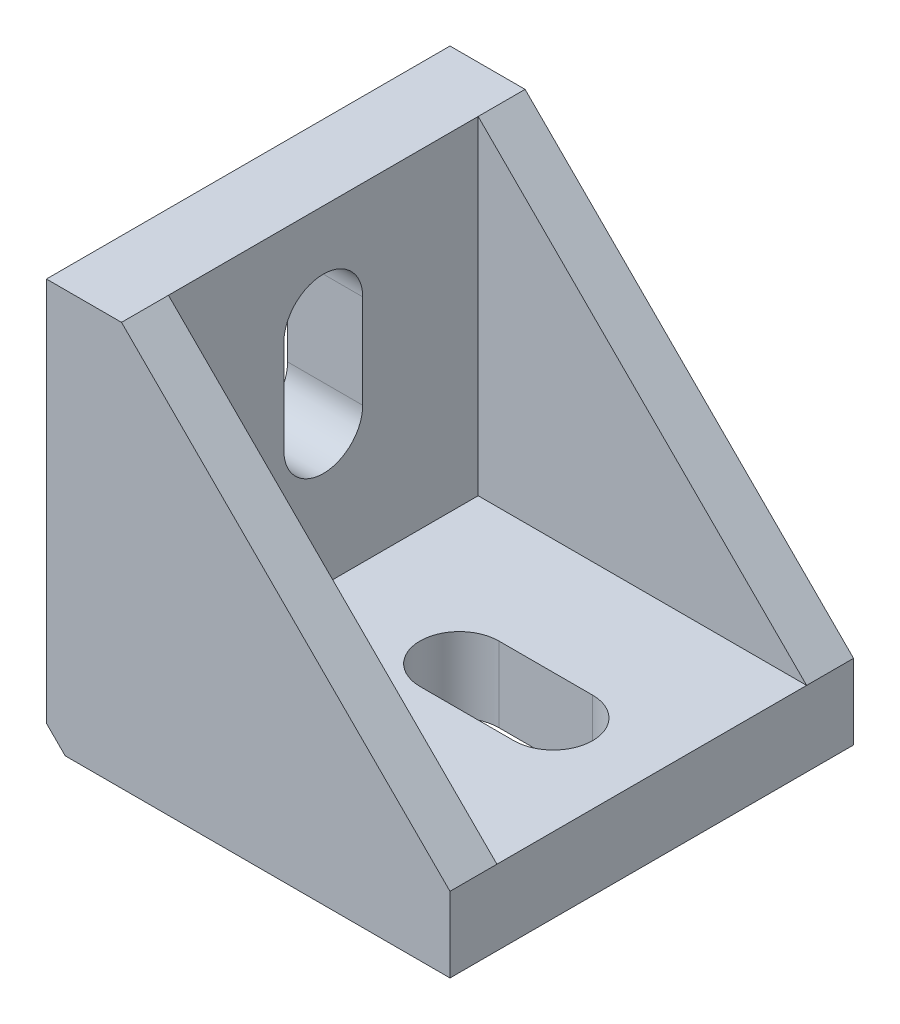
ISO-10303-21;
HEADER;
FILE_DESCRIPTION(('STEP AP214'),'2;1');
FILE_NAME('part.step','',(''),(''),'','','');
FILE_SCHEMA(('AUTOMOTIVE_DESIGN { 1 0 10303 214 1 1 1 1 }'));
ENDSEC;
DATA;
#1=APPLICATION_CONTEXT('core data for automotive mechanical design processes');
#2=APPLICATION_PROTOCOL_DEFINITION('international standard','automotive_design',2000,#1);
#3=PRODUCT_CONTEXT('',#1,'mechanical');
#4=PRODUCT('Part','Part','',(#3));
#5=PRODUCT_RELATED_PRODUCT_CATEGORY('part','',(#4));
#6=PRODUCT_DEFINITION_FORMATION('','',#4);
#7=PRODUCT_DEFINITION_CONTEXT('part definition',#1,'design');
#8=PRODUCT_DEFINITION('design','',#6,#7);
#9=PRODUCT_DEFINITION_SHAPE('','',#8);
#10=(LENGTH_UNIT() NAMED_UNIT(*) SI_UNIT(.MILLI.,.METRE.));
#11=(NAMED_UNIT(*) PLANE_ANGLE_UNIT() SI_UNIT($,.RADIAN.));
#12=(NAMED_UNIT(*) SI_UNIT($,.STERADIAN.) SOLID_ANGLE_UNIT());
#13=UNCERTAINTY_MEASURE_WITH_UNIT(LENGTH_MEASURE(1.E-05),#10,'distance_accuracy_value','');
#14=(GEOMETRIC_REPRESENTATION_CONTEXT(3) GLOBAL_UNCERTAINTY_ASSIGNED_CONTEXT((#13)) GLOBAL_UNIT_ASSIGNED_CONTEXT((#10,
#11,#12)) REPRESENTATION_CONTEXT('',''));
#15=CARTESIAN_POINT('',(0.,0.,0.));
#16=DIRECTION('',(0.,0.,1.));
#17=DIRECTION('',(1.,0.,0.));
#18=AXIS2_PLACEMENT_3D('',#15,#16,#17);
#19=CARTESIAN_POINT('',(0.,43.,43.));
#20=DIRECTION('',(1.,0.,0.));
#21=DIRECTION('',(0.,0.,-1.));
#22=AXIS2_PLACEMENT_3D('',#19,#20,#21);
#23=PLANE('',#22);
#24=DIRECTION('',(0.,-1.,0.));
#25=VECTOR('',#24,1.);
#26=CARTESIAN_POINT('',(0.,43.,0.));
#27=LINE('',#26,#25);
#28=CARTESIAN_POINT('',(0.,43.,0.));
#29=VERTEX_POINT('',#28);
#30=CARTESIAN_POINT('',(0.,2.,0.));
#31=VERTEX_POINT('',#30);
#32=EDGE_CURVE('E247',#29,#31,#27,.T.);
#33=ORIENTED_EDGE('',*,*,#32,.T.);
#34=DIRECTION('',(0.,0.,1.));
#35=VECTOR('',#34,1.);
#36=CARTESIAN_POINT('',(0.,2.,43.));
#37=LINE('',#36,#35);
#38=CARTESIAN_POINT('',(0.,2.,43.));
#39=VERTEX_POINT('',#38);
#40=EDGE_CURVE('E45',#31,#39,#37,.T.);
#41=ORIENTED_EDGE('',*,*,#40,.T.);
#42=DIRECTION('',(0.,-1.,0.));
#43=VECTOR('',#42,1.);
#44=CARTESIAN_POINT('',(0.,43.,43.));
#45=LINE('',#44,#43);
#46=CARTESIAN_POINT('',(0.,43.,43.));
#47=VERTEX_POINT('',#46);
#48=EDGE_CURVE('E235',#47,#39,#45,.T.);
#49=ORIENTED_EDGE('',*,*,#48,.F.);
#50=DIRECTION('',(0.,0.,-1.));
#51=VECTOR('',#50,1.);
#52=CARTESIAN_POINT('',(0.,43.,43.));
#53=LINE('',#52,#51);
#54=EDGE_CURVE('E268',#47,#29,#53,.T.);
#55=ORIENTED_EDGE('',*,*,#54,.T.);
#56=EDGE_LOOP('',(#33,#41,#49,#55));
#57=FACE_BOUND('',#56,.T.);
#58=CARTESIAN_POINT('',(0.,22.5,21.5));
#59=DIRECTION('',(1.,0.,0.));
#60=DIRECTION('',(0.,1.,0.));
#61=AXIS2_PLACEMENT_3D('',#58,#59,#60);
#62=CIRCLE('',#61,4.2);
#63=CARTESIAN_POINT('',(0.,22.5,25.7));
#64=VERTEX_POINT('',#63);
#65=CARTESIAN_POINT('',(0.,22.5,17.3));
#66=VERTEX_POINT('',#65);
#67=EDGE_CURVE('E194',#64,#66,#62,.T.);
#68=ORIENTED_EDGE('',*,*,#67,.T.);
#69=DIRECTION('',(0.,1.,0.));
#70=VECTOR('',#69,1.);
#71=CARTESIAN_POINT('',(0.,22.5,17.3));
#72=LINE('',#71,#70);
#73=CARTESIAN_POINT('',(0.,32.5,17.3));
#74=VERTEX_POINT('',#73);
#75=EDGE_CURVE('E200',#66,#74,#72,.T.);
#76=ORIENTED_EDGE('',*,*,#75,.T.);
#77=CARTESIAN_POINT('',(0.,32.5,21.5));
#78=DIRECTION('',(1.,0.,0.));
#79=DIRECTION('',(0.,1.,0.));
#80=AXIS2_PLACEMENT_3D('',#77,#78,#79);
#81=CIRCLE('',#80,4.2);
#82=CARTESIAN_POINT('',(0.,32.5,25.7));
#83=VERTEX_POINT('',#82);
#84=EDGE_CURVE('E203',#74,#83,#81,.T.);
#85=ORIENTED_EDGE('',*,*,#84,.T.);
#86=DIRECTION('',(0.,-1.,0.));
#87=VECTOR('',#86,1.);
#88=CARTESIAN_POINT('',(0.,22.5,25.7));
#89=LINE('',#88,#87);
#90=EDGE_CURVE('E206',#83,#64,#89,.T.);
#91=ORIENTED_EDGE('',*,*,#90,.T.);
#92=EDGE_LOOP('',(#68,#76,#85,#91));
#93=FACE_BOUND('',#92,.T.);
#94=ADVANCED_FACE('F37',(#57,#93),#23,.F.);
#95=CARTESIAN_POINT('',(8.,43.5587514450867,5.));
#96=DIRECTION('',(-1.,0.,0.));
#97=DIRECTION('',(0.,-1.,0.));
#98=AXIS2_PLACEMENT_3D('',#95,#96,#97);
#99=PLANE('',#98);
#100=DIRECTION('',(0.,-1.,0.));
#101=VECTOR('',#100,1.);
#102=CARTESIAN_POINT('',(8.,43.5587514450867,38.));
#103=LINE('',#102,#101);
#104=CARTESIAN_POINT('',(8.,43.,38.));
#105=VERTEX_POINT('',#104);
#106=CARTESIAN_POINT('',(8.,8.,38.));
#107=VERTEX_POINT('',#106);
#108=EDGE_CURVE('E218',#105,#107,#103,.T.);
#109=ORIENTED_EDGE('',*,*,#108,.T.);
#110=DIRECTION('',(0.,0.,1.));
#111=VECTOR('',#110,1.);
#112=CARTESIAN_POINT('',(8.,8.,5.));
#113=LINE('',#112,#111);
#114=CARTESIAN_POINT('',(8.,8.,5.));
#115=VERTEX_POINT('',#114);
#116=EDGE_CURVE('E225',#115,#107,#113,.T.);
#117=ORIENTED_EDGE('',*,*,#116,.F.);
#118=DIRECTION('',(0.,-1.,0.));
#119=VECTOR('',#118,1.);
#120=CARTESIAN_POINT('',(8.,43.5587514450867,5.));
#121=LINE('',#120,#119);
#122=CARTESIAN_POINT('',(7.99999999999999,43.,5.));
#123=VERTEX_POINT('',#122);
#124=EDGE_CURVE('E219',#123,#115,#121,.T.);
#125=ORIENTED_EDGE('',*,*,#124,.F.);
#126=DIRECTION('',(0.,0.,-1.));
#127=VECTOR('',#126,1.);
#128=CARTESIAN_POINT('',(8.,43.,43.));
#129=LINE('',#128,#127);
#130=EDGE_CURVE('E260',#105,#123,#129,.T.);
#131=ORIENTED_EDGE('',*,*,#130,.F.);
#132=EDGE_LOOP('',(#109,#117,#125,#131));
#133=FACE_BOUND('',#132,.T.);
#134=CARTESIAN_POINT('',(8.,22.5,21.5));
#135=DIRECTION('',(-1.,0.,0.));
#136=DIRECTION('',(0.,-1.,0.));
#137=AXIS2_PLACEMENT_3D('',#134,#135,#136);
#138=CIRCLE('',#137,4.2);
#139=CARTESIAN_POINT('',(8.,22.5,25.7));
#140=VERTEX_POINT('',#139);
#141=CARTESIAN_POINT('',(8.,22.5,17.3));
#142=VERTEX_POINT('',#141);
#143=EDGE_CURVE('E283',#140,#142,#138,.F.);
#144=ORIENTED_EDGE('',*,*,#143,.F.);
#145=DIRECTION('',(0.,-1.,0.));
#146=VECTOR('',#145,1.);
#147=CARTESIAN_POINT('',(8.,43.5587514450867,25.7));
#148=LINE('',#147,#146);
#149=CARTESIAN_POINT('',(8.,32.5,25.7));
#150=VERTEX_POINT('',#149);
#151=EDGE_CURVE('E276',#150,#140,#148,.T.);
#152=ORIENTED_EDGE('',*,*,#151,.F.);
#153=CARTESIAN_POINT('',(8.,32.5,21.5));
#154=DIRECTION('',(-1.,0.,0.));
#155=DIRECTION('',(0.,-1.,0.));
#156=AXIS2_PLACEMENT_3D('',#153,#154,#155);
#157=CIRCLE('',#156,4.2);
#158=CARTESIAN_POINT('',(8.,32.5,17.3));
#159=VERTEX_POINT('',#158);
#160=EDGE_CURVE('E278',#159,#150,#157,.F.);
#161=ORIENTED_EDGE('',*,*,#160,.F.);
#162=DIRECTION('',(0.,1.,0.));
#163=VECTOR('',#162,1.);
#164=CARTESIAN_POINT('',(8.,43.5587514450867,17.3));
#165=LINE('',#164,#163);
#166=EDGE_CURVE('E281',#142,#159,#165,.T.);
#167=ORIENTED_EDGE('',*,*,#166,.F.);
#168=EDGE_LOOP('',(#144,#152,#161,#167));
#169=FACE_BOUND('',#168,.T.);
#170=ADVANCED_FACE('F314',(#133,#169),#99,.F.);
#171=CARTESIAN_POINT('',(43.,8.,43.));
#172=DIRECTION('',(-0.707106781186547,-0.707106781186548,0.));
#173=DIRECTION('',(0.707106781186548,-0.707106781186547,0.));
#174=AXIS2_PLACEMENT_3D('',#171,#172,#173);
#175=PLANE('',#174);
#176=DIRECTION('',(0.707106781186548,-0.707106781186547,0.));
#177=VECTOR('',#176,1.);
#178=CARTESIAN_POINT('',(43.,8.,38.));
#179=LINE('',#178,#177);
#180=CARTESIAN_POINT('',(43.,8.,38.));
#181=VERTEX_POINT('',#180);
#182=EDGE_CURVE('E271',#105,#181,#179,.T.);
#183=ORIENTED_EDGE('',*,*,#182,.F.);
#184=CARTESIAN_POINT('',(8.,43.,43.));
#185=VERTEX_POINT('',#184);
#186=EDGE_CURVE('E256',#185,#105,#129,.T.);
#187=ORIENTED_EDGE('',*,*,#186,.F.);
#188=DIRECTION('',(-0.707106781186548,0.707106781186547,0.));
#189=VECTOR('',#188,1.);
#190=CARTESIAN_POINT('',(43.,8.,43.));
#191=LINE('',#190,#189);
#192=CARTESIAN_POINT('',(43.,8.,43.));
#193=VERTEX_POINT('',#192);
#194=EDGE_CURVE('E242',#193,#185,#191,.T.);
#195=ORIENTED_EDGE('',*,*,#194,.F.);
#196=DIRECTION('',(0.,0.,-1.));
#197=VECTOR('',#196,1.);
#198=CARTESIAN_POINT('',(43.,8.,43.));
#199=LINE('',#198,#197);
#200=EDGE_CURVE('E261',#193,#181,#199,.T.);
#201=ORIENTED_EDGE('',*,*,#200,.T.);
#202=EDGE_LOOP('',(#183,#187,#195,#201));
#203=FACE_BOUND('',#202,.T.);
#204=ADVANCED_FACE('F319',(#203),#175,.F.);
#205=CARTESIAN_POINT('',(8.,43.,43.));
#206=DIRECTION('',(0.,-1.,0.));
#207=DIRECTION('',(0.,0.,-1.));
#208=AXIS2_PLACEMENT_3D('',#205,#206,#207);
#209=PLANE('',#208);
#210=DIRECTION('',(-1.,0.,0.));
#211=VECTOR('',#210,1.);
#212=CARTESIAN_POINT('',(8.,43.,0.));
#213=LINE('',#212,#211);
#214=CARTESIAN_POINT('',(8.,43.,0.));
#215=VERTEX_POINT('',#214);
#216=EDGE_CURVE('E231',#215,#29,#213,.T.);
#217=ORIENTED_EDGE('',*,*,#216,.T.);
#218=ORIENTED_EDGE('',*,*,#54,.F.);
#219=DIRECTION('',(-1.,0.,0.));
#220=VECTOR('',#219,1.);
#221=CARTESIAN_POINT('',(8.,43.,43.));
#222=LINE('',#221,#220);
#223=EDGE_CURVE('E232',#185,#47,#222,.T.);
#224=ORIENTED_EDGE('',*,*,#223,.F.);
#225=ORIENTED_EDGE('',*,*,#186,.T.);
#226=ORIENTED_EDGE('',*,*,#130,.T.);
#227=EDGE_CURVE('E244',#123,#215,#129,.T.);
#228=ORIENTED_EDGE('',*,*,#227,.T.);
#229=EDGE_LOOP('',(#217,#218,#224,#225,#226,#228));
#230=FACE_BOUND('',#229,.T.);
#231=ADVANCED_FACE('F325',(#230),#209,.F.);
#232=CARTESIAN_POINT('',(0.,0.,43.));
#233=DIRECTION('',(0.,1.,0.));
#234=DIRECTION('',(0.,0.,1.));
#235=AXIS2_PLACEMENT_3D('',#232,#233,#234);
#236=PLANE('',#235);
#237=DIRECTION('',(1.,0.,0.));
#238=VECTOR('',#237,1.);
#239=CARTESIAN_POINT('',(32.5,0.,25.7));
#240=LINE('',#239,#238);
#241=CARTESIAN_POINT('',(22.5,0.,25.7));
#242=VERTEX_POINT('',#241);
#243=CARTESIAN_POINT('',(32.5,0.,25.7));
#244=VERTEX_POINT('',#243);
#245=EDGE_CURVE('E166',#242,#244,#240,.T.);
#246=ORIENTED_EDGE('',*,*,#245,.T.);
#247=CARTESIAN_POINT('',(32.5,0.,21.5));
#248=DIRECTION('',(0.,1.,0.));
#249=DIRECTION('',(0.,0.,1.));
#250=AXIS2_PLACEMENT_3D('',#247,#248,#249);
#251=CIRCLE('',#250,4.19999999999999);
#252=CARTESIAN_POINT('',(32.5,0.,17.3));
#253=VERTEX_POINT('',#252);
#254=EDGE_CURVE('E158',#244,#253,#251,.T.);
#255=ORIENTED_EDGE('',*,*,#254,.T.);
#256=DIRECTION('',(-1.,0.,0.));
#257=VECTOR('',#256,1.);
#258=CARTESIAN_POINT('',(32.5,0.,17.3));
#259=LINE('',#258,#257);
#260=CARTESIAN_POINT('',(22.5,0.,17.3));
#261=VERTEX_POINT('',#260);
#262=EDGE_CURVE('E170',#253,#261,#259,.T.);
#263=ORIENTED_EDGE('',*,*,#262,.T.);
#264=CARTESIAN_POINT('',(22.5,0.,21.5));
#265=DIRECTION('',(0.,1.,0.));
#266=DIRECTION('',(0.,0.,1.));
#267=AXIS2_PLACEMENT_3D('',#264,#265,#266);
#268=CIRCLE('',#267,4.19999999999999);
#269=EDGE_CURVE('E174',#261,#242,#268,.T.);
#270=ORIENTED_EDGE('',*,*,#269,.T.);
#271=EDGE_LOOP('',(#246,#255,#263,#270));
#272=FACE_BOUND('',#271,.T.);
#273=DIRECTION('',(1.,0.,0.));
#274=VECTOR('',#273,1.);
#275=CARTESIAN_POINT('',(0.,0.,43.));
#276=LINE('',#275,#274);
#277=CARTESIAN_POINT('',(1.99999999999999,0.,43.));
#278=VERTEX_POINT('',#277);
#279=CARTESIAN_POINT('',(43.,0.,43.));
#280=VERTEX_POINT('',#279);
#281=EDGE_CURVE('E238',#278,#280,#276,.T.);
#282=ORIENTED_EDGE('',*,*,#281,.F.);
#283=DIRECTION('',(0.,0.,-1.));
#284=VECTOR('',#283,1.);
#285=CARTESIAN_POINT('',(1.99999999999999,0.,43.));
#286=LINE('',#285,#284);
#287=CARTESIAN_POINT('',(1.99999999999999,0.,0.));
#288=VERTEX_POINT('',#287);
#289=EDGE_CURVE('E285',#278,#288,#286,.T.);
#290=ORIENTED_EDGE('',*,*,#289,.T.);
#291=DIRECTION('',(1.,0.,0.));
#292=VECTOR('',#291,1.);
#293=CARTESIAN_POINT('',(0.,0.,0.));
#294=LINE('',#293,#292);
#295=CARTESIAN_POINT('',(43.,0.,0.));
#296=VERTEX_POINT('',#295);
#297=EDGE_CURVE('E249',#288,#296,#294,.T.);
#298=ORIENTED_EDGE('',*,*,#297,.T.);
#299=DIRECTION('',(0.,0.,-1.));
#300=VECTOR('',#299,1.);
#301=CARTESIAN_POINT('',(43.,0.,43.));
#302=LINE('',#301,#300);
#303=EDGE_CURVE('E264',#280,#296,#302,.T.);
#304=ORIENTED_EDGE('',*,*,#303,.F.);
#305=EDGE_LOOP('',(#282,#290,#298,#304));
#306=FACE_BOUND('',#305,.T.);
#307=ADVANCED_FACE('F176',(#272,#306),#236,.F.);
#308=CARTESIAN_POINT('',(43.,0.,43.));
#309=DIRECTION('',(-1.,0.,0.));
#310=DIRECTION('',(0.,0.,1.));
#311=AXIS2_PLACEMENT_3D('',#308,#309,#310);
#312=PLANE('',#311);
#313=DIRECTION('',(0.,1.,0.));
#314=VECTOR('',#313,1.);
#315=CARTESIAN_POINT('',(43.,0.,0.));
#316=LINE('',#315,#314);
#317=CARTESIAN_POINT('',(43.,8.,0.));
#318=VERTEX_POINT('',#317);
#319=EDGE_CURVE('E251',#296,#318,#316,.T.);
#320=ORIENTED_EDGE('',*,*,#319,.T.);
#321=CARTESIAN_POINT('',(43.,8.,5.));
#322=VERTEX_POINT('',#321);
#323=EDGE_CURVE('E259',#322,#318,#199,.T.);
#324=ORIENTED_EDGE('',*,*,#323,.F.);
#325=EDGE_CURVE('E265',#181,#322,#199,.T.);
#326=ORIENTED_EDGE('',*,*,#325,.F.);
#327=ORIENTED_EDGE('',*,*,#200,.F.);
#328=DIRECTION('',(0.,1.,0.));
#329=VECTOR('',#328,1.);
#330=CARTESIAN_POINT('',(43.,0.,43.));
#331=LINE('',#330,#329);
#332=EDGE_CURVE('E240',#280,#193,#331,.T.);
#333=ORIENTED_EDGE('',*,*,#332,.F.);
#334=ORIENTED_EDGE('',*,*,#303,.T.);
#335=EDGE_LOOP('',(#320,#324,#326,#327,#333,#334));
#336=FACE_BOUND('',#335,.T.);
#337=ADVANCED_FACE('F299',(#336),#312,.F.);
#338=ORIENTED_EDGE('',*,*,#227,.F.);
#339=DIRECTION('',(0.707106781186548,-0.707106781186547,0.));
#340=VECTOR('',#339,1.);
#341=CARTESIAN_POINT('',(43.,8.,5.));
#342=LINE('',#341,#340);
#343=EDGE_CURVE('E273',#123,#322,#342,.T.);
#344=ORIENTED_EDGE('',*,*,#343,.T.);
#345=ORIENTED_EDGE('',*,*,#323,.T.);
#346=DIRECTION('',(-0.707106781186548,0.707106781186547,0.));
#347=VECTOR('',#346,1.);
#348=CARTESIAN_POINT('',(43.,8.,0.));
#349=LINE('',#348,#347);
#350=EDGE_CURVE('E236',#318,#215,#349,.T.);
#351=ORIENTED_EDGE('',*,*,#350,.T.);
#352=EDGE_LOOP('',(#338,#344,#345,#351));
#353=FACE_BOUND('',#352,.T.);
#354=ADVANCED_FACE('F334',(#353),#175,.F.);
#355=CARTESIAN_POINT('',(0.,0.,43.));
#356=DIRECTION('',(0.,0.,1.));
#357=DIRECTION('',(1.,0.,0.));
#358=AXIS2_PLACEMENT_3D('',#355,#356,#357);
#359=PLANE('',#358);
#360=ORIENTED_EDGE('',*,*,#48,.T.);
#361=DIRECTION('',(-0.707106781186546,0.707106781186549,0.));
#362=VECTOR('',#361,1.);
#363=CARTESIAN_POINT('',(1.,0.999999999999997,43.));
#364=LINE('',#363,#362);
#365=EDGE_CURVE('E11',#39,#278,#364,.F.);
#366=ORIENTED_EDGE('',*,*,#365,.T.);
#367=ORIENTED_EDGE('',*,*,#281,.T.);
#368=ORIENTED_EDGE('',*,*,#332,.T.);
#369=ORIENTED_EDGE('',*,*,#194,.T.);
#370=ORIENTED_EDGE('',*,*,#223,.T.);
#371=EDGE_LOOP('',(#360,#366,#367,#368,#369,#370));
#372=FACE_BOUND('',#371,.T.);
#373=ADVANCED_FACE('F305',(#372),#359,.T.);
#374=CARTESIAN_POINT('',(0.,0.,0.));
#375=DIRECTION('',(0.,0.,1.));
#376=DIRECTION('',(1.,0.,0.));
#377=AXIS2_PLACEMENT_3D('',#374,#375,#376);
#378=PLANE('',#377);
#379=ORIENTED_EDGE('',*,*,#297,.F.);
#380=DIRECTION('',(0.707106781186546,-0.707106781186549,0.));
#381=VECTOR('',#380,1.);
#382=CARTESIAN_POINT('',(1.99999999999999,0.,0.));
#383=LINE('',#382,#381);
#384=EDGE_CURVE('E59',#288,#31,#383,.F.);
#385=ORIENTED_EDGE('',*,*,#384,.T.);
#386=ORIENTED_EDGE('',*,*,#32,.F.);
#387=ORIENTED_EDGE('',*,*,#216,.F.);
#388=ORIENTED_EDGE('',*,*,#350,.F.);
#389=ORIENTED_EDGE('',*,*,#319,.F.);
#390=EDGE_LOOP('',(#379,#385,#386,#387,#388,#389));
#391=FACE_BOUND('',#390,.T.);
#392=ADVANCED_FACE('F294',(#391),#378,.F.);
#393=CARTESIAN_POINT('',(8.,8.,5.));
#394=DIRECTION('',(0.,-1.,0.));
#395=DIRECTION('',(0.,0.,-1.));
#396=AXIS2_PLACEMENT_3D('',#393,#394,#395);
#397=PLANE('',#396);
#398=DIRECTION('',(-1.,0.,0.));
#399=VECTOR('',#398,1.);
#400=CARTESIAN_POINT('',(32.5,8.,17.3));
#401=LINE('',#400,#399);
#402=CARTESIAN_POINT('',(32.5,8.,17.3));
#403=VERTEX_POINT('',#402);
#404=CARTESIAN_POINT('',(22.5,8.,17.3));
#405=VERTEX_POINT('',#404);
#406=EDGE_CURVE('E188',#403,#405,#401,.T.);
#407=ORIENTED_EDGE('',*,*,#406,.F.);
#408=CARTESIAN_POINT('',(32.5,8.,21.5));
#409=DIRECTION('',(0.,1.,0.));
#410=DIRECTION('',(0.,0.,1.));
#411=AXIS2_PLACEMENT_3D('',#408,#409,#410);
#412=CIRCLE('',#411,4.19999999999999);
#413=CARTESIAN_POINT('',(32.5,8.,25.7));
#414=VERTEX_POINT('',#413);
#415=EDGE_CURVE('E161',#414,#403,#412,.T.);
#416=ORIENTED_EDGE('',*,*,#415,.F.);
#417=DIRECTION('',(1.,0.,0.));
#418=VECTOR('',#417,1.);
#419=CARTESIAN_POINT('',(32.5,8.,25.7));
#420=LINE('',#419,#418);
#421=CARTESIAN_POINT('',(22.5,8.,25.7));
#422=VERTEX_POINT('',#421);
#423=EDGE_CURVE('E179',#422,#414,#420,.T.);
#424=ORIENTED_EDGE('',*,*,#423,.F.);
#425=CARTESIAN_POINT('',(22.5,8.,21.5));
#426=DIRECTION('',(0.,1.,0.));
#427=DIRECTION('',(0.,0.,1.));
#428=AXIS2_PLACEMENT_3D('',#425,#426,#427);
#429=CIRCLE('',#428,4.19999999999999);
#430=EDGE_CURVE('E182',#405,#422,#429,.T.);
#431=ORIENTED_EDGE('',*,*,#430,.F.);
#432=EDGE_LOOP('',(#407,#416,#424,#431));
#433=FACE_BOUND('',#432,.T.);
#434=DIRECTION('',(1.,0.,0.));
#435=VECTOR('',#434,1.);
#436=CARTESIAN_POINT('',(8.,8.,5.));
#437=LINE('',#436,#435);
#438=EDGE_CURVE('E221',#115,#322,#437,.T.);
#439=ORIENTED_EDGE('',*,*,#438,.F.);
#440=ORIENTED_EDGE('',*,*,#116,.T.);
#441=DIRECTION('',(1.,0.,0.));
#442=VECTOR('',#441,1.);
#443=CARTESIAN_POINT('',(8.,8.,38.));
#444=LINE('',#443,#442);
#445=EDGE_CURVE('E222',#107,#181,#444,.T.);
#446=ORIENTED_EDGE('',*,*,#445,.T.);
#447=ORIENTED_EDGE('',*,*,#325,.T.);
#448=EDGE_LOOP('',(#439,#440,#446,#447));
#449=FACE_BOUND('',#448,.T.);
#450=ADVANCED_FACE('F346',(#433,#449),#397,.F.);
#451=CARTESIAN_POINT('',(0.,0.,5.));
#452=DIRECTION('',(0.,0.,-1.));
#453=DIRECTION('',(-1.,0.,0.));
#454=AXIS2_PLACEMENT_3D('',#451,#452,#453);
#455=PLANE('',#454);
#456=ORIENTED_EDGE('',*,*,#124,.T.);
#457=ORIENTED_EDGE('',*,*,#438,.T.);
#458=ORIENTED_EDGE('',*,*,#343,.F.);
#459=EDGE_LOOP('',(#456,#457,#458));
#460=FACE_BOUND('',#459,.T.);
#461=ADVANCED_FACE('F351',(#460),#455,.F.);
#462=CARTESIAN_POINT('',(0.,0.,38.));
#463=DIRECTION('',(0.,0.,-1.));
#464=DIRECTION('',(-1.,0.,0.));
#465=AXIS2_PLACEMENT_3D('',#462,#463,#464);
#466=PLANE('',#465);
#467=ORIENTED_EDGE('',*,*,#182,.T.);
#468=ORIENTED_EDGE('',*,*,#445,.F.);
#469=ORIENTED_EDGE('',*,*,#108,.F.);
#470=EDGE_LOOP('',(#467,#468,#469));
#471=FACE_BOUND('',#470,.T.);
#472=ADVANCED_FACE('F343',(#471),#466,.T.);
#473=CARTESIAN_POINT('',(43.,22.5,21.5));
#474=DIRECTION('',(-1.,0.,0.));
#475=DIRECTION('',(0.,-1.,0.));
#476=AXIS2_PLACEMENT_3D('',#473,#474,#475);
#477=CYLINDRICAL_SURFACE('',#476,4.2);
#478=ORIENTED_EDGE('',*,*,#143,.T.);
#479=DIRECTION('',(-1.,0.,0.));
#480=VECTOR('',#479,1.);
#481=CARTESIAN_POINT('',(43.,22.5,17.3));
#482=LINE('',#481,#480);
#483=EDGE_CURVE('E216',#142,#66,#482,.T.);
#484=ORIENTED_EDGE('',*,*,#483,.T.);
#485=ORIENTED_EDGE('',*,*,#67,.F.);
#486=DIRECTION('',(-1.,0.,0.));
#487=VECTOR('',#486,1.);
#488=CARTESIAN_POINT('',(43.,22.5,25.7));
#489=LINE('',#488,#487);
#490=EDGE_CURVE('E209',#140,#64,#489,.T.);
#491=ORIENTED_EDGE('',*,*,#490,.F.);
#492=EDGE_LOOP('',(#478,#484,#485,#491));
#493=FACE_BOUND('',#492,.T.);
#494=ADVANCED_FACE('F360',(#493),#477,.F.);
#495=CARTESIAN_POINT('',(43.,22.5,17.3));
#496=DIRECTION('',(0.,0.,1.));
#497=DIRECTION('',(1.,0.,0.));
#498=AXIS2_PLACEMENT_3D('',#495,#496,#497);
#499=PLANE('',#498);
#500=ORIENTED_EDGE('',*,*,#166,.T.);
#501=DIRECTION('',(-1.,0.,0.));
#502=VECTOR('',#501,1.);
#503=CARTESIAN_POINT('',(43.,32.5,17.3));
#504=LINE('',#503,#502);
#505=EDGE_CURVE('E214',#159,#74,#504,.T.);
#506=ORIENTED_EDGE('',*,*,#505,.T.);
#507=ORIENTED_EDGE('',*,*,#75,.F.);
#508=ORIENTED_EDGE('',*,*,#483,.F.);
#509=EDGE_LOOP('',(#500,#506,#507,#508));
#510=FACE_BOUND('',#509,.T.);
#511=ADVANCED_FACE('F363',(#510),#499,.T.);
#512=CARTESIAN_POINT('',(43.,32.5,21.5));
#513=DIRECTION('',(-1.,0.,0.));
#514=DIRECTION('',(0.,-1.,0.));
#515=AXIS2_PLACEMENT_3D('',#512,#513,#514);
#516=CYLINDRICAL_SURFACE('',#515,4.2);
#517=ORIENTED_EDGE('',*,*,#160,.T.);
#518=DIRECTION('',(-1.,0.,0.));
#519=VECTOR('',#518,1.);
#520=CARTESIAN_POINT('',(43.,32.5,25.7));
#521=LINE('',#520,#519);
#522=EDGE_CURVE('E212',#150,#83,#521,.T.);
#523=ORIENTED_EDGE('',*,*,#522,.T.);
#524=ORIENTED_EDGE('',*,*,#84,.F.);
#525=ORIENTED_EDGE('',*,*,#505,.F.);
#526=EDGE_LOOP('',(#517,#523,#524,#525));
#527=FACE_BOUND('',#526,.T.);
#528=ADVANCED_FACE('F370',(#527),#516,.F.);
#529=CARTESIAN_POINT('',(43.,22.5,25.7));
#530=DIRECTION('',(0.,0.,-1.));
#531=DIRECTION('',(-1.,0.,0.));
#532=AXIS2_PLACEMENT_3D('',#529,#530,#531);
#533=PLANE('',#532);
#534=ORIENTED_EDGE('',*,*,#151,.T.);
#535=ORIENTED_EDGE('',*,*,#490,.T.);
#536=ORIENTED_EDGE('',*,*,#90,.F.);
#537=ORIENTED_EDGE('',*,*,#522,.F.);
#538=EDGE_LOOP('',(#534,#535,#536,#537));
#539=FACE_BOUND('',#538,.T.);
#540=ADVANCED_FACE('F368',(#539),#533,.T.);
#541=CARTESIAN_POINT('',(32.5,0.,21.5));
#542=DIRECTION('',(0.,1.,0.));
#543=DIRECTION('',(0.,0.,1.));
#544=AXIS2_PLACEMENT_3D('',#541,#542,#543);
#545=CYLINDRICAL_SURFACE('',#544,4.19999999999999);
#546=ORIENTED_EDGE('',*,*,#415,.T.);
#547=DIRECTION('',(0.,1.,0.));
#548=VECTOR('',#547,1.);
#549=CARTESIAN_POINT('',(32.5,0.,17.3));
#550=LINE('',#549,#548);
#551=EDGE_CURVE('E154',#253,#403,#550,.T.);
#552=ORIENTED_EDGE('',*,*,#551,.F.);
#553=ORIENTED_EDGE('',*,*,#254,.F.);
#554=DIRECTION('',(0.,1.,0.));
#555=VECTOR('',#554,1.);
#556=CARTESIAN_POINT('',(32.5,0.,25.7));
#557=LINE('',#556,#555);
#558=EDGE_CURVE('E192',#244,#414,#557,.T.);
#559=ORIENTED_EDGE('',*,*,#558,.T.);
#560=EDGE_LOOP('',(#546,#552,#553,#559));
#561=FACE_BOUND('',#560,.T.);
#562=ADVANCED_FACE('F156',(#561),#545,.F.);
#563=CARTESIAN_POINT('',(32.5,0.,25.7));
#564=DIRECTION('',(0.,0.,1.));
#565=DIRECTION('',(1.,0.,0.));
#566=AXIS2_PLACEMENT_3D('',#563,#564,#565);
#567=PLANE('',#566);
#568=ORIENTED_EDGE('',*,*,#423,.T.);
#569=ORIENTED_EDGE('',*,*,#558,.F.);
#570=ORIENTED_EDGE('',*,*,#245,.F.);
#571=DIRECTION('',(0.,1.,0.));
#572=VECTOR('',#571,1.);
#573=CARTESIAN_POINT('',(22.5,0.,25.7));
#574=LINE('',#573,#572);
#575=EDGE_CURVE('E195',#242,#422,#574,.T.);
#576=ORIENTED_EDGE('',*,*,#575,.T.);
#577=EDGE_LOOP('',(#568,#569,#570,#576));
#578=FACE_BOUND('',#577,.T.);
#579=ADVANCED_FACE('F451',(#578),#567,.F.);
#580=CARTESIAN_POINT('',(22.5,0.,21.5));
#581=DIRECTION('',(0.,1.,0.));
#582=DIRECTION('',(0.,0.,1.));
#583=AXIS2_PLACEMENT_3D('',#580,#581,#582);
#584=CYLINDRICAL_SURFACE('',#583,4.19999999999999);
#585=ORIENTED_EDGE('',*,*,#430,.T.);
#586=ORIENTED_EDGE('',*,*,#575,.F.);
#587=ORIENTED_EDGE('',*,*,#269,.F.);
#588=DIRECTION('',(0.,1.,0.));
#589=VECTOR('',#588,1.);
#590=CARTESIAN_POINT('',(22.5,0.,17.3));
#591=LINE('',#590,#589);
#592=EDGE_CURVE('E165',#261,#405,#591,.T.);
#593=ORIENTED_EDGE('',*,*,#592,.T.);
#594=EDGE_LOOP('',(#585,#586,#587,#593));
#595=FACE_BOUND('',#594,.T.);
#596=ADVANCED_FACE('F311',(#595),#584,.F.);
#597=CARTESIAN_POINT('',(32.5,0.,17.3));
#598=DIRECTION('',(0.,0.,-1.));
#599=DIRECTION('',(-1.,0.,0.));
#600=AXIS2_PLACEMENT_3D('',#597,#598,#599);
#601=PLANE('',#600);
#602=ORIENTED_EDGE('',*,*,#406,.T.);
#603=ORIENTED_EDGE('',*,*,#592,.F.);
#604=ORIENTED_EDGE('',*,*,#262,.F.);
#605=ORIENTED_EDGE('',*,*,#551,.T.);
#606=EDGE_LOOP('',(#602,#603,#604,#605));
#607=FACE_BOUND('',#606,.T.);
#608=ADVANCED_FACE('F171',(#607),#601,.F.);
#609=CARTESIAN_POINT('',(1.99999999999999,0.,43.));
#610=DIRECTION('',(0.707106781186549,0.707106781186546,0.));
#611=DIRECTION('',(0.,0.,-1.));
#612=AXIS2_PLACEMENT_3D('',#609,#610,#611);
#613=PLANE('',#612);
#614=ORIENTED_EDGE('',*,*,#365,.F.);
#615=ORIENTED_EDGE('',*,*,#40,.F.);
#616=ORIENTED_EDGE('',*,*,#384,.F.);
#617=ORIENTED_EDGE('',*,*,#289,.F.);
#618=EDGE_LOOP('',(#614,#615,#616,#617));
#619=FACE_BOUND('',#618,.T.);
#620=ADVANCED_FACE('F39',(#619),#613,.F.);
#621=CLOSED_SHELL('',(#94,#170,#204,#231,#307,#337,#354,#373,#392,#450,#461,#472,#494,#511,#528,
#540,#562,#579,#596,#608,#620));
#622=MANIFOLD_SOLID_BREP('B2',#621);
#623=ADVANCED_BREP_SHAPE_REPRESENTATION('',(#18,#622),#14);
#624=SHAPE_DEFINITION_REPRESENTATION(#9,#623);
ENDSEC;
END-ISO-10303-21;
